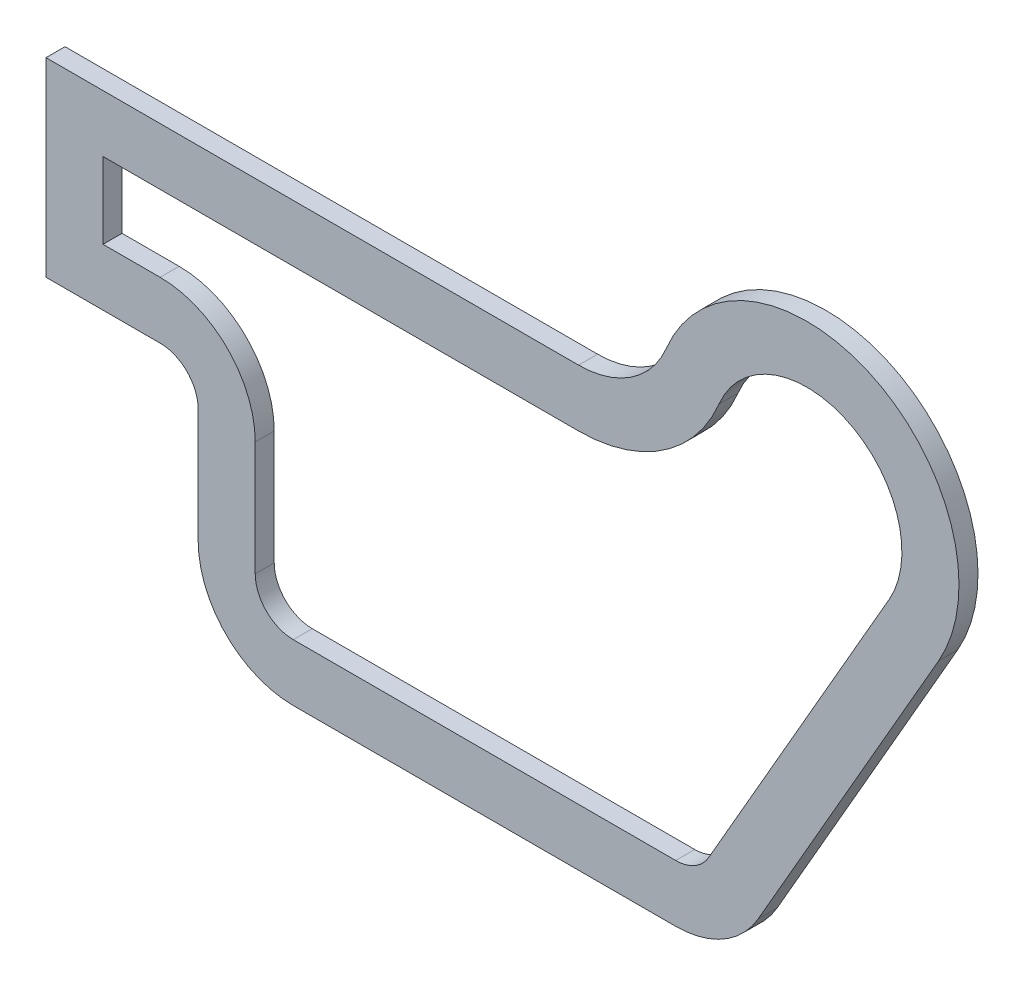
ISO-10303-21;
HEADER;
FILE_DESCRIPTION(('STEP AP214'),'2;1');
FILE_NAME('part.step','',(''),(''),'','','');
FILE_SCHEMA(('AUTOMOTIVE_DESIGN { 1 0 10303 214 1 1 1 1 }'));
ENDSEC;
DATA;
#1=APPLICATION_CONTEXT('core data for automotive mechanical design processes');
#2=APPLICATION_PROTOCOL_DEFINITION('international standard','automotive_design',2000,#1);
#3=PRODUCT_CONTEXT('',#1,'mechanical');
#4=PRODUCT('Part','Part','',(#3));
#5=PRODUCT_RELATED_PRODUCT_CATEGORY('part','',(#4));
#6=PRODUCT_DEFINITION_FORMATION('','',#4);
#7=PRODUCT_DEFINITION_CONTEXT('part definition',#1,'design');
#8=PRODUCT_DEFINITION('design','',#6,#7);
#9=PRODUCT_DEFINITION_SHAPE('','',#8);
#10=(LENGTH_UNIT() NAMED_UNIT(*) SI_UNIT(.MILLI.,.METRE.));
#11=(NAMED_UNIT(*) PLANE_ANGLE_UNIT() SI_UNIT($,.RADIAN.));
#12=(NAMED_UNIT(*) SI_UNIT($,.STERADIAN.) SOLID_ANGLE_UNIT());
#13=UNCERTAINTY_MEASURE_WITH_UNIT(LENGTH_MEASURE(1.E-05),#10,'distance_accuracy_value','');
#14=(GEOMETRIC_REPRESENTATION_CONTEXT(3) GLOBAL_UNCERTAINTY_ASSIGNED_CONTEXT((#13)) GLOBAL_UNIT_ASSIGNED_CONTEXT((#10,
#11,#12)) REPRESENTATION_CONTEXT('',''));
#15=CARTESIAN_POINT('',(0.,0.,0.));
#16=DIRECTION('',(0.,0.,1.));
#17=DIRECTION('',(1.,0.,0.));
#18=AXIS2_PLACEMENT_3D('',#15,#16,#17);
#19=CARTESIAN_POINT('',(140.,140.,0.));
#20=DIRECTION('',(0.,0.,-1.));
#21=DIRECTION('',(-1.,0.,0.));
#22=AXIS2_PLACEMENT_3D('',#19,#20,#21);
#23=PLANE('',#22);
#24=CARTESIAN_POINT('',(140.,140.,0.));
#25=DIRECTION('',(0.,0.,-1.));
#26=DIRECTION('',(-1.,0.,0.));
#27=AXIS2_PLACEMENT_3D('',#24,#25,#26);
#28=CIRCLE('',#27,25.);
#29=CARTESIAN_POINT('',(163.076923076923,130.384615384615,0.));
#30=VERTEX_POINT('',#29);
#31=CARTESIAN_POINT('',(140.,115.,0.));
#32=VERTEX_POINT('',#31);
#33=EDGE_CURVE('E314',#30,#32,#28,.T.);
#34=ORIENTED_EDGE('',*,*,#33,.F.);
#35=CARTESIAN_POINT('',(200.,115.,0.));
#36=DIRECTION('',(0.,0.,1.));
#37=DIRECTION('',(1.,0.,0.));
#38=AXIS2_PLACEMENT_3D('',#35,#36,#37);
#39=CIRCLE('',#38,40.);
#40=CARTESIAN_POINT('',(234.67371600643,95.05674504236,0.));
#41=VERTEX_POINT('',#40);
#42=EDGE_CURVE('E283',#41,#30,#39,.T.);
#43=ORIENTED_EDGE('',*,*,#42,.F.);
#44=DIRECTION('',(0.498581373941001,0.866842900160752,0.));
#45=VECTOR('',#44,1.);
#46=CARTESIAN_POINT('',(234.67371600643,95.05674504236,0.));
#47=LINE('',#46,#45);
#48=CARTESIAN_POINT('',(187.210014278647,12.5354656514751,0.));
#49=VERTEX_POINT('',#48);
#50=EDGE_CURVE('E342',#49,#41,#47,.T.);
#51=ORIENTED_EDGE('',*,*,#50,.F.);
#52=CARTESIAN_POINT('',(165.538941774628,25.,0.));
#53=DIRECTION('',(0.,0.,1.));
#54=DIRECTION('',(-1.,0.,0.));
#55=AXIS2_PLACEMENT_3D('',#52,#53,#54);
#56=CIRCLE('',#55,25.);
#57=CARTESIAN_POINT('',(165.538941774628,0.,0.));
#58=VERTEX_POINT('',#57);
#59=EDGE_CURVE('E339',#58,#49,#56,.T.);
#60=ORIENTED_EDGE('',*,*,#59,.F.);
#61=DIRECTION('',(1.,0.,0.));
#62=VECTOR('',#61,1.);
#63=CARTESIAN_POINT('',(165.538941774628,0.,0.));
#64=LINE('',#63,#62);
#65=CARTESIAN_POINT('',(65.0000000000002,0.,0.));
#66=VERTEX_POINT('',#65);
#67=EDGE_CURVE('E336',#66,#58,#64,.T.);
#68=ORIENTED_EDGE('',*,*,#67,.F.);
#69=CARTESIAN_POINT('',(65.,25.,0.));
#70=DIRECTION('',(0.,0.,1.));
#71=DIRECTION('',(-1.,0.,0.));
#72=AXIS2_PLACEMENT_3D('',#69,#70,#71);
#73=CIRCLE('',#72,25.);
#74=CARTESIAN_POINT('',(40.,25.,0.));
#75=VERTEX_POINT('',#74);
#76=EDGE_CURVE('E333',#75,#66,#73,.T.);
#77=ORIENTED_EDGE('',*,*,#76,.F.);
#78=DIRECTION('',(0.,-1.,0.));
#79=VECTOR('',#78,1.);
#80=CARTESIAN_POINT('',(40.,54.9999999999999,0.));
#81=LINE('',#80,#79);
#82=CARTESIAN_POINT('',(40.,54.9999999999999,0.));
#83=VERTEX_POINT('',#82);
#84=EDGE_CURVE('E330',#83,#75,#81,.T.);
#85=ORIENTED_EDGE('',*,*,#84,.F.);
#86=CARTESIAN_POINT('',(30.,55.,0.));
#87=DIRECTION('',(0.,0.,-1.));
#88=DIRECTION('',(1.,0.,0.));
#89=AXIS2_PLACEMENT_3D('',#86,#87,#88);
#90=CIRCLE('',#89,10.);
#91=CARTESIAN_POINT('',(29.9999999999999,65.,0.));
#92=VERTEX_POINT('',#91);
#93=EDGE_CURVE('E327',#92,#83,#90,.T.);
#94=ORIENTED_EDGE('',*,*,#93,.F.);
#95=DIRECTION('',(1.,0.,0.));
#96=VECTOR('',#95,1.);
#97=CARTESIAN_POINT('',(0.,65.,0.));
#98=LINE('',#97,#96);
#99=CARTESIAN_POINT('',(0.,65.,0.));
#100=VERTEX_POINT('',#99);
#101=EDGE_CURVE('E324',#100,#92,#98,.T.);
#102=ORIENTED_EDGE('',*,*,#101,.F.);
#103=DIRECTION('',(0.,-1.,0.));
#104=VECTOR('',#103,1.);
#105=CARTESIAN_POINT('',(0.,115.,0.));
#106=LINE('',#105,#104);
#107=CARTESIAN_POINT('',(0.,115.,0.));
#108=VERTEX_POINT('',#107);
#109=EDGE_CURVE('E321',#108,#100,#106,.T.);
#110=ORIENTED_EDGE('',*,*,#109,.F.);
#111=DIRECTION('',(-1.,0.,0.));
#112=VECTOR('',#111,1.);
#113=CARTESIAN_POINT('',(140.,115.,0.));
#114=LINE('',#113,#112);
#115=EDGE_CURVE('E318',#32,#108,#114,.T.);
#116=ORIENTED_EDGE('',*,*,#115,.F.);
#117=EDGE_LOOP('',(#34,#43,#51,#60,#68,#77,#85,#94,#102,#110,#116));
#118=FACE_BOUND('',#117,.T.);
#119=CARTESIAN_POINT('',(200.,115.,0.));
#120=DIRECTION('',(0.,0.,-1.));
#121=DIRECTION('',(-1.,0.,0.));
#122=AXIS2_PLACEMENT_3D('',#119,#120,#121);
#123=CIRCLE('',#122,25.);
#124=CARTESIAN_POINT('',(221.671072504019,102.535465651475,0.));
#125=VERTEX_POINT('',#124);
#126=CARTESIAN_POINT('',(176.923076923077,124.615384615385,0.));
#127=VERTEX_POINT('',#126);
#128=EDGE_CURVE('E191',#125,#127,#123,.F.);
#129=ORIENTED_EDGE('',*,*,#128,.T.);
#130=CARTESIAN_POINT('',(140.,140.,0.));
#131=DIRECTION('',(0.,0.,-1.));
#132=DIRECTION('',(-1.,0.,0.));
#133=AXIS2_PLACEMENT_3D('',#130,#131,#132);
#134=CIRCLE('',#133,40.);
#135=CARTESIAN_POINT('',(140.,100.,0.));
#136=VERTEX_POINT('',#135);
#137=EDGE_CURVE('E201',#127,#136,#134,.T.);
#138=ORIENTED_EDGE('',*,*,#137,.T.);
#139=DIRECTION('',(-1.,0.,0.));
#140=VECTOR('',#139,1.);
#141=CARTESIAN_POINT('',(140.,100.,0.));
#142=LINE('',#141,#140);
#143=CARTESIAN_POINT('',(15.,100.,0.));
#144=VERTEX_POINT('',#143);
#145=EDGE_CURVE('E208',#136,#144,#142,.T.);
#146=ORIENTED_EDGE('',*,*,#145,.T.);
#147=DIRECTION('',(0.,-1.,0.));
#148=VECTOR('',#147,1.);
#149=CARTESIAN_POINT('',(15.,140.,0.));
#150=LINE('',#149,#148);
#151=CARTESIAN_POINT('',(15.,80.,0.));
#152=VERTEX_POINT('',#151);
#153=EDGE_CURVE('E62',#144,#152,#150,.T.);
#154=ORIENTED_EDGE('',*,*,#153,.T.);
#155=DIRECTION('',(1.,0.,0.));
#156=VECTOR('',#155,1.);
#157=CARTESIAN_POINT('',(140.,80.,0.));
#158=LINE('',#157,#156);
#159=CARTESIAN_POINT('',(29.9999999999999,80.,0.));
#160=VERTEX_POINT('',#159);
#161=EDGE_CURVE('E242',#152,#160,#158,.T.);
#162=ORIENTED_EDGE('',*,*,#161,.T.);
#163=CARTESIAN_POINT('',(30.,55.,0.));
#164=DIRECTION('',(0.,0.,-1.));
#165=DIRECTION('',(-1.,0.,0.));
#166=AXIS2_PLACEMENT_3D('',#163,#164,#165);
#167=CIRCLE('',#166,25.);
#168=CARTESIAN_POINT('',(55.,54.9999999999998,0.));
#169=VERTEX_POINT('',#168);
#170=EDGE_CURVE('E238',#160,#169,#167,.T.);
#171=ORIENTED_EDGE('',*,*,#170,.T.);
#172=DIRECTION('',(0.,-1.,0.));
#173=VECTOR('',#172,1.);
#174=CARTESIAN_POINT('',(55.,140.,0.));
#175=LINE('',#174,#173);
#176=CARTESIAN_POINT('',(55.,25.,0.));
#177=VERTEX_POINT('',#176);
#178=EDGE_CURVE('E234',#169,#177,#175,.T.);
#179=ORIENTED_EDGE('',*,*,#178,.T.);
#180=CARTESIAN_POINT('',(65.,25.,0.));
#181=DIRECTION('',(0.,0.,-1.));
#182=DIRECTION('',(-1.,0.,0.));
#183=AXIS2_PLACEMENT_3D('',#180,#181,#182);
#184=CIRCLE('',#183,10.);
#185=CARTESIAN_POINT('',(65.0000000000001,15.,0.));
#186=VERTEX_POINT('',#185);
#187=EDGE_CURVE('E230',#177,#186,#184,.F.);
#188=ORIENTED_EDGE('',*,*,#187,.T.);
#189=DIRECTION('',(1.,0.,0.));
#190=VECTOR('',#189,1.);
#191=CARTESIAN_POINT('',(140.,15.,0.));
#192=LINE('',#191,#190);
#193=CARTESIAN_POINT('',(165.538941774628,15.,0.));
#194=VERTEX_POINT('',#193);
#195=EDGE_CURVE('E226',#186,#194,#192,.T.);
#196=ORIENTED_EDGE('',*,*,#195,.T.);
#197=CARTESIAN_POINT('',(165.538941774628,25.,0.));
#198=DIRECTION('',(0.,0.,-1.));
#199=DIRECTION('',(-1.,0.,0.));
#200=AXIS2_PLACEMENT_3D('',#197,#198,#199);
#201=CIRCLE('',#200,10.);
#202=CARTESIAN_POINT('',(174.207370776236,20.01418626059,0.));
#203=VERTEX_POINT('',#202);
#204=EDGE_CURVE('E220',#194,#203,#201,.F.);
#205=ORIENTED_EDGE('',*,*,#204,.T.);
#206=DIRECTION('',(0.498581373941001,0.866842900160752,0.));
#207=VECTOR('',#206,1.);
#208=CARTESIAN_POINT('',(217.560862421394,95.3893775412636,0.));
#209=LINE('',#208,#207);
#210=EDGE_CURVE('E212',#203,#125,#209,.T.);
#211=ORIENTED_EDGE('',*,*,#210,.T.);
#212=EDGE_LOOP('',(#129,#138,#146,#154,#162,#171,#179,#188,#196,#205,#211));
#213=FACE_BOUND('',#212,.T.);
#214=ADVANCED_FACE('F38',(#118,#213),#23,.T.);
#215=CARTESIAN_POINT('',(140.,140.,5.));
#216=DIRECTION('',(0.,0.,-1.));
#217=DIRECTION('',(-1.,0.,0.));
#218=AXIS2_PLACEMENT_3D('',#215,#216,#217);
#219=CYLINDRICAL_SURFACE('',#218,25.);
#220=ORIENTED_EDGE('',*,*,#33,.T.);
#221=DIRECTION('',(0.,0.,-1.));
#222=VECTOR('',#221,1.);
#223=CARTESIAN_POINT('',(140.,115.,5.));
#224=LINE('',#223,#222);
#225=CARTESIAN_POINT('',(140.,115.,5.));
#226=VERTEX_POINT('',#225);
#227=EDGE_CURVE('E11',#226,#32,#224,.T.);
#228=ORIENTED_EDGE('',*,*,#227,.F.);
#229=CARTESIAN_POINT('',(140.,140.,5.));
#230=DIRECTION('',(0.,0.,-1.));
#231=DIRECTION('',(-1.,0.,0.));
#232=AXIS2_PLACEMENT_3D('',#229,#230,#231);
#233=CIRCLE('',#232,25.);
#234=CARTESIAN_POINT('',(163.076923076923,130.384615384615,5.));
#235=VERTEX_POINT('',#234);
#236=EDGE_CURVE('E278',#235,#226,#233,.T.);
#237=ORIENTED_EDGE('',*,*,#236,.F.);
#238=DIRECTION('',(0.,0.,-1.));
#239=VECTOR('',#238,1.);
#240=CARTESIAN_POINT('',(163.076923076923,130.384615384615,5.));
#241=LINE('',#240,#239);
#242=EDGE_CURVE('E313',#235,#30,#241,.T.);
#243=ORIENTED_EDGE('',*,*,#242,.T.);
#244=EDGE_LOOP('',(#220,#228,#237,#243));
#245=FACE_BOUND('',#244,.T.);
#246=ADVANCED_FACE('F40',(#245),#219,.F.);
#247=CARTESIAN_POINT('',(140.,115.,5.));
#248=DIRECTION('',(0.,-1.,0.));
#249=DIRECTION('',(0.,0.,-1.));
#250=AXIS2_PLACEMENT_3D('',#247,#248,#249);
#251=PLANE('',#250);
#252=ORIENTED_EDGE('',*,*,#115,.T.);
#253=DIRECTION('',(0.,0.,-1.));
#254=VECTOR('',#253,1.);
#255=CARTESIAN_POINT('',(0.,115.,5.));
#256=LINE('',#255,#254);
#257=CARTESIAN_POINT('',(0.,115.,5.));
#258=VERTEX_POINT('',#257);
#259=EDGE_CURVE('E47',#258,#108,#256,.T.);
#260=ORIENTED_EDGE('',*,*,#259,.F.);
#261=DIRECTION('',(-1.,0.,0.));
#262=VECTOR('',#261,1.);
#263=CARTESIAN_POINT('',(140.,115.,5.));
#264=LINE('',#263,#262);
#265=EDGE_CURVE('E282',#226,#258,#264,.T.);
#266=ORIENTED_EDGE('',*,*,#265,.F.);
#267=ORIENTED_EDGE('',*,*,#227,.T.);
#268=EDGE_LOOP('',(#252,#260,#266,#267));
#269=FACE_BOUND('',#268,.T.);
#270=ADVANCED_FACE('F409',(#269),#251,.F.);
#271=CARTESIAN_POINT('',(0.,115.,5.));
#272=DIRECTION('',(1.,0.,0.));
#273=DIRECTION('',(0.,0.,-1.));
#274=AXIS2_PLACEMENT_3D('',#271,#272,#273);
#275=PLANE('',#274);
#276=ORIENTED_EDGE('',*,*,#109,.T.);
#277=DIRECTION('',(0.,0.,-1.));
#278=VECTOR('',#277,1.);
#279=CARTESIAN_POINT('',(0.,65.,5.));
#280=LINE('',#279,#278);
#281=CARTESIAN_POINT('',(0.,65.,5.));
#282=VERTEX_POINT('',#281);
#283=EDGE_CURVE('E378',#282,#100,#280,.T.);
#284=ORIENTED_EDGE('',*,*,#283,.F.);
#285=DIRECTION('',(0.,-1.,0.));
#286=VECTOR('',#285,1.);
#287=CARTESIAN_POINT('',(0.,115.,5.));
#288=LINE('',#287,#286);
#289=EDGE_CURVE('E286',#258,#282,#288,.T.);
#290=ORIENTED_EDGE('',*,*,#289,.F.);
#291=ORIENTED_EDGE('',*,*,#259,.T.);
#292=EDGE_LOOP('',(#276,#284,#290,#291));
#293=FACE_BOUND('',#292,.T.);
#294=ADVANCED_FACE('F387',(#293),#275,.F.);
#295=CARTESIAN_POINT('',(0.,65.,5.));
#296=DIRECTION('',(0.,1.,0.));
#297=DIRECTION('',(0.,0.,1.));
#298=AXIS2_PLACEMENT_3D('',#295,#296,#297);
#299=PLANE('',#298);
#300=ORIENTED_EDGE('',*,*,#101,.T.);
#301=DIRECTION('',(0.,0.,-1.));
#302=VECTOR('',#301,1.);
#303=CARTESIAN_POINT('',(29.9999999999999,65.,5.));
#304=LINE('',#303,#302);
#305=CARTESIAN_POINT('',(29.9999999999999,65.,5.));
#306=VERTEX_POINT('',#305);
#307=EDGE_CURVE('E374',#306,#92,#304,.T.);
#308=ORIENTED_EDGE('',*,*,#307,.F.);
#309=DIRECTION('',(1.,0.,0.));
#310=VECTOR('',#309,1.);
#311=CARTESIAN_POINT('',(0.,65.,5.));
#312=LINE('',#311,#310);
#313=EDGE_CURVE('E289',#282,#306,#312,.T.);
#314=ORIENTED_EDGE('',*,*,#313,.F.);
#315=ORIENTED_EDGE('',*,*,#283,.T.);
#316=EDGE_LOOP('',(#300,#308,#314,#315));
#317=FACE_BOUND('',#316,.T.);
#318=ADVANCED_FACE('F397',(#317),#299,.F.);
#319=CARTESIAN_POINT('',(30.,55.,5.));
#320=DIRECTION('',(0.,0.,-1.));
#321=DIRECTION('',(-1.,0.,0.));
#322=AXIS2_PLACEMENT_3D('',#319,#320,#321);
#323=CYLINDRICAL_SURFACE('',#322,10.);
#324=ORIENTED_EDGE('',*,*,#93,.T.);
#325=DIRECTION('',(0.,0.,-1.));
#326=VECTOR('',#325,1.);
#327=CARTESIAN_POINT('',(40.,54.9999999999999,5.));
#328=LINE('',#327,#326);
#329=CARTESIAN_POINT('',(40.,54.9999999999999,5.));
#330=VERTEX_POINT('',#329);
#331=EDGE_CURVE('E370',#330,#83,#328,.T.);
#332=ORIENTED_EDGE('',*,*,#331,.F.);
#333=CARTESIAN_POINT('',(30.,55.,5.));
#334=DIRECTION('',(0.,0.,-1.));
#335=DIRECTION('',(1.,0.,0.));
#336=AXIS2_PLACEMENT_3D('',#333,#334,#335);
#337=CIRCLE('',#336,10.);
#338=EDGE_CURVE('E292',#306,#330,#337,.T.);
#339=ORIENTED_EDGE('',*,*,#338,.F.);
#340=ORIENTED_EDGE('',*,*,#307,.T.);
#341=EDGE_LOOP('',(#324,#332,#339,#340));
#342=FACE_BOUND('',#341,.T.);
#343=ADVANCED_FACE('F401',(#342),#323,.F.);
#344=CARTESIAN_POINT('',(40.,54.9999999999999,5.));
#345=DIRECTION('',(1.,0.,0.));
#346=DIRECTION('',(0.,1.,0.));
#347=AXIS2_PLACEMENT_3D('',#344,#345,#346);
#348=PLANE('',#347);
#349=ORIENTED_EDGE('',*,*,#84,.T.);
#350=DIRECTION('',(0.,0.,-1.));
#351=VECTOR('',#350,1.);
#352=CARTESIAN_POINT('',(40.,25.,5.));
#353=LINE('',#352,#351);
#354=CARTESIAN_POINT('',(40.,25.,5.));
#355=VERTEX_POINT('',#354);
#356=EDGE_CURVE('E366',#355,#75,#353,.T.);
#357=ORIENTED_EDGE('',*,*,#356,.F.);
#358=DIRECTION('',(0.,-1.,0.));
#359=VECTOR('',#358,1.);
#360=CARTESIAN_POINT('',(40.,54.9999999999999,5.));
#361=LINE('',#360,#359);
#362=EDGE_CURVE('E295',#330,#355,#361,.T.);
#363=ORIENTED_EDGE('',*,*,#362,.F.);
#364=ORIENTED_EDGE('',*,*,#331,.T.);
#365=EDGE_LOOP('',(#349,#357,#363,#364));
#366=FACE_BOUND('',#365,.T.);
#367=ADVANCED_FACE('F437',(#366),#348,.F.);
#368=CARTESIAN_POINT('',(65.,25.,5.));
#369=DIRECTION('',(0.,0.,-1.));
#370=DIRECTION('',(-1.,0.,0.));
#371=AXIS2_PLACEMENT_3D('',#368,#369,#370);
#372=CYLINDRICAL_SURFACE('',#371,25.);
#373=ORIENTED_EDGE('',*,*,#76,.T.);
#374=DIRECTION('',(0.,0.,-1.));
#375=VECTOR('',#374,1.);
#376=CARTESIAN_POINT('',(65.0000000000002,0.,5.));
#377=LINE('',#376,#375);
#378=CARTESIAN_POINT('',(65.0000000000002,0.,5.));
#379=VERTEX_POINT('',#378);
#380=EDGE_CURVE('E362',#379,#66,#377,.T.);
#381=ORIENTED_EDGE('',*,*,#380,.F.);
#382=CARTESIAN_POINT('',(65.,25.,5.));
#383=DIRECTION('',(0.,0.,1.));
#384=DIRECTION('',(-1.,0.,0.));
#385=AXIS2_PLACEMENT_3D('',#382,#383,#384);
#386=CIRCLE('',#385,25.);
#387=EDGE_CURVE('E298',#355,#379,#386,.T.);
#388=ORIENTED_EDGE('',*,*,#387,.F.);
#389=ORIENTED_EDGE('',*,*,#356,.T.);
#390=EDGE_LOOP('',(#373,#381,#388,#389));
#391=FACE_BOUND('',#390,.T.);
#392=ADVANCED_FACE('F435',(#391),#372,.T.);
#393=CARTESIAN_POINT('',(165.538941774628,0.,5.));
#394=DIRECTION('',(0.,1.,0.));
#395=DIRECTION('',(-1.,0.,0.));
#396=AXIS2_PLACEMENT_3D('',#393,#394,#395);
#397=PLANE('',#396);
#398=ORIENTED_EDGE('',*,*,#67,.T.);
#399=DIRECTION('',(0.,0.,-1.));
#400=VECTOR('',#399,1.);
#401=CARTESIAN_POINT('',(165.538941774628,0.,5.));
#402=LINE('',#401,#400);
#403=CARTESIAN_POINT('',(165.538941774628,0.,5.));
#404=VERTEX_POINT('',#403);
#405=EDGE_CURVE('E358',#404,#58,#402,.T.);
#406=ORIENTED_EDGE('',*,*,#405,.F.);
#407=DIRECTION('',(1.,0.,0.));
#408=VECTOR('',#407,1.);
#409=CARTESIAN_POINT('',(165.538941774628,0.,5.));
#410=LINE('',#409,#408);
#411=EDGE_CURVE('E301',#379,#404,#410,.T.);
#412=ORIENTED_EDGE('',*,*,#411,.F.);
#413=ORIENTED_EDGE('',*,*,#380,.T.);
#414=EDGE_LOOP('',(#398,#406,#412,#413));
#415=FACE_BOUND('',#414,.T.);
#416=ADVANCED_FACE('F430',(#415),#397,.F.);
#417=CARTESIAN_POINT('',(165.538941774628,25.,5.));
#418=DIRECTION('',(0.,0.,-1.));
#419=DIRECTION('',(-1.,0.,0.));
#420=AXIS2_PLACEMENT_3D('',#417,#418,#419);
#421=CYLINDRICAL_SURFACE('',#420,25.);
#422=ORIENTED_EDGE('',*,*,#59,.T.);
#423=DIRECTION('',(0.,0.,-1.));
#424=VECTOR('',#423,1.);
#425=CARTESIAN_POINT('',(187.210014278647,12.5354656514751,5.));
#426=LINE('',#425,#424);
#427=CARTESIAN_POINT('',(187.210014278647,12.5354656514751,5.));
#428=VERTEX_POINT('',#427);
#429=EDGE_CURVE('E354',#428,#49,#426,.T.);
#430=ORIENTED_EDGE('',*,*,#429,.F.);
#431=CARTESIAN_POINT('',(165.538941774628,25.,5.));
#432=DIRECTION('',(0.,0.,1.));
#433=DIRECTION('',(-1.,0.,0.));
#434=AXIS2_PLACEMENT_3D('',#431,#432,#433);
#435=CIRCLE('',#434,25.);
#436=EDGE_CURVE('E304',#404,#428,#435,.T.);
#437=ORIENTED_EDGE('',*,*,#436,.F.);
#438=ORIENTED_EDGE('',*,*,#405,.T.);
#439=EDGE_LOOP('',(#422,#430,#437,#438));
#440=FACE_BOUND('',#439,.T.);
#441=ADVANCED_FACE('F425',(#440),#421,.T.);
#442=CARTESIAN_POINT('',(234.67371600643,95.05674504236,5.));
#443=DIRECTION('',(-0.866842900160752,0.498581373941001,0.));
#444=DIRECTION('',(-0.498581373941001,-0.866842900160752,0.));
#445=AXIS2_PLACEMENT_3D('',#442,#443,#444);
#446=PLANE('',#445);
#447=ORIENTED_EDGE('',*,*,#50,.T.);
#448=DIRECTION('',(0.,0.,-1.));
#449=VECTOR('',#448,1.);
#450=CARTESIAN_POINT('',(234.67371600643,95.05674504236,5.));
#451=LINE('',#450,#449);
#452=CARTESIAN_POINT('',(234.67371600643,95.05674504236,5.));
#453=VERTEX_POINT('',#452);
#454=EDGE_CURVE('E350',#453,#41,#451,.T.);
#455=ORIENTED_EDGE('',*,*,#454,.F.);
#456=DIRECTION('',(0.498581373941001,0.866842900160752,0.));
#457=VECTOR('',#456,1.);
#458=CARTESIAN_POINT('',(234.67371600643,95.05674504236,5.));
#459=LINE('',#458,#457);
#460=EDGE_CURVE('E307',#428,#453,#459,.T.);
#461=ORIENTED_EDGE('',*,*,#460,.F.);
#462=ORIENTED_EDGE('',*,*,#429,.T.);
#463=EDGE_LOOP('',(#447,#455,#461,#462));
#464=FACE_BOUND('',#463,.T.);
#465=ADVANCED_FACE('F421',(#464),#446,.F.);
#466=CARTESIAN_POINT('',(200.,115.,5.));
#467=DIRECTION('',(0.,0.,-1.));
#468=DIRECTION('',(-1.,0.,0.));
#469=AXIS2_PLACEMENT_3D('',#466,#467,#468);
#470=CYLINDRICAL_SURFACE('',#469,40.);
#471=ORIENTED_EDGE('',*,*,#42,.T.);
#472=ORIENTED_EDGE('',*,*,#242,.F.);
#473=CARTESIAN_POINT('',(200.,115.,5.));
#474=DIRECTION('',(0.,0.,1.));
#475=DIRECTION('',(1.,0.,0.));
#476=AXIS2_PLACEMENT_3D('',#473,#474,#475);
#477=CIRCLE('',#476,40.);
#478=EDGE_CURVE('E310',#453,#235,#477,.T.);
#479=ORIENTED_EDGE('',*,*,#478,.F.);
#480=ORIENTED_EDGE('',*,*,#454,.T.);
#481=EDGE_LOOP('',(#471,#472,#479,#480));
#482=FACE_BOUND('',#481,.T.);
#483=ADVANCED_FACE('F416',(#482),#470,.T.);
#484=CARTESIAN_POINT('',(140.,140.,5.));
#485=DIRECTION('',(0.,0.,-1.));
#486=DIRECTION('',(-1.,0.,0.));
#487=AXIS2_PLACEMENT_3D('',#484,#485,#486);
#488=PLANE('',#487);
#489=CARTESIAN_POINT('',(140.,140.,5.));
#490=DIRECTION('',(0.,0.,-1.));
#491=DIRECTION('',(-1.,0.,0.));
#492=AXIS2_PLACEMENT_3D('',#489,#490,#491);
#493=CIRCLE('',#492,40.);
#494=CARTESIAN_POINT('',(176.923076923077,124.615384615385,5.));
#495=VERTEX_POINT('',#494);
#496=CARTESIAN_POINT('',(140.,100.,5.));
#497=VERTEX_POINT('',#496);
#498=EDGE_CURVE('E214',#495,#497,#493,.T.);
#499=ORIENTED_EDGE('',*,*,#498,.F.);
#500=CARTESIAN_POINT('',(200.,115.,5.));
#501=DIRECTION('',(0.,0.,-1.));
#502=DIRECTION('',(-1.,0.,0.));
#503=AXIS2_PLACEMENT_3D('',#500,#501,#502);
#504=CIRCLE('',#503,25.);
#505=CARTESIAN_POINT('',(221.671072504019,102.535465651475,5.));
#506=VERTEX_POINT('',#505);
#507=EDGE_CURVE('E194',#506,#495,#504,.F.);
#508=ORIENTED_EDGE('',*,*,#507,.F.);
#509=DIRECTION('',(0.498581373941001,0.866842900160752,0.));
#510=VECTOR('',#509,1.);
#511=CARTESIAN_POINT('',(217.560862421394,95.3893775412636,5.));
#512=LINE('',#511,#510);
#513=CARTESIAN_POINT('',(174.207370776236,20.01418626059,5.));
#514=VERTEX_POINT('',#513);
#515=EDGE_CURVE('E273',#514,#506,#512,.T.);
#516=ORIENTED_EDGE('',*,*,#515,.F.);
#517=CARTESIAN_POINT('',(165.538941774628,25.,5.));
#518=DIRECTION('',(0.,0.,-1.));
#519=DIRECTION('',(-1.,0.,0.));
#520=AXIS2_PLACEMENT_3D('',#517,#518,#519);
#521=CIRCLE('',#520,10.);
#522=CARTESIAN_POINT('',(165.538941774628,15.,5.));
#523=VERTEX_POINT('',#522);
#524=EDGE_CURVE('E270',#523,#514,#521,.F.);
#525=ORIENTED_EDGE('',*,*,#524,.F.);
#526=DIRECTION('',(1.,0.,0.));
#527=VECTOR('',#526,1.);
#528=CARTESIAN_POINT('',(140.,15.,5.));
#529=LINE('',#528,#527);
#530=CARTESIAN_POINT('',(65.0000000000001,15.,5.));
#531=VERTEX_POINT('',#530);
#532=EDGE_CURVE('E267',#531,#523,#529,.T.);
#533=ORIENTED_EDGE('',*,*,#532,.F.);
#534=CARTESIAN_POINT('',(65.,25.,5.));
#535=DIRECTION('',(0.,0.,-1.));
#536=DIRECTION('',(-1.,0.,0.));
#537=AXIS2_PLACEMENT_3D('',#534,#535,#536);
#538=CIRCLE('',#537,10.);
#539=CARTESIAN_POINT('',(55.,25.,5.));
#540=VERTEX_POINT('',#539);
#541=EDGE_CURVE('E264',#540,#531,#538,.F.);
#542=ORIENTED_EDGE('',*,*,#541,.F.);
#543=DIRECTION('',(0.,-1.,0.));
#544=VECTOR('',#543,1.);
#545=CARTESIAN_POINT('',(55.,140.,5.));
#546=LINE('',#545,#544);
#547=CARTESIAN_POINT('',(55.,54.9999999999998,5.));
#548=VERTEX_POINT('',#547);
#549=EDGE_CURVE('E261',#548,#540,#546,.T.);
#550=ORIENTED_EDGE('',*,*,#549,.F.);
#551=CARTESIAN_POINT('',(30.,55.,5.));
#552=DIRECTION('',(0.,0.,-1.));
#553=DIRECTION('',(-1.,0.,0.));
#554=AXIS2_PLACEMENT_3D('',#551,#552,#553);
#555=CIRCLE('',#554,25.);
#556=CARTESIAN_POINT('',(29.9999999999999,80.,5.));
#557=VERTEX_POINT('',#556);
#558=EDGE_CURVE('E258',#557,#548,#555,.T.);
#559=ORIENTED_EDGE('',*,*,#558,.F.);
#560=DIRECTION('',(1.,0.,0.));
#561=VECTOR('',#560,1.);
#562=CARTESIAN_POINT('',(140.,80.,5.));
#563=LINE('',#562,#561);
#564=CARTESIAN_POINT('',(15.,80.,5.));
#565=VERTEX_POINT('',#564);
#566=EDGE_CURVE('E255',#565,#557,#563,.T.);
#567=ORIENTED_EDGE('',*,*,#566,.F.);
#568=DIRECTION('',(0.,-1.,0.));
#569=VECTOR('',#568,1.);
#570=CARTESIAN_POINT('',(15.,140.,5.));
#571=LINE('',#570,#569);
#572=CARTESIAN_POINT('',(15.,100.,5.));
#573=VERTEX_POINT('',#572);
#574=EDGE_CURVE('E252',#573,#565,#571,.T.);
#575=ORIENTED_EDGE('',*,*,#574,.F.);
#576=DIRECTION('',(-1.,0.,0.));
#577=VECTOR('',#576,1.);
#578=CARTESIAN_POINT('',(140.,100.,5.));
#579=LINE('',#578,#577);
#580=EDGE_CURVE('E218',#497,#573,#579,.T.);
#581=ORIENTED_EDGE('',*,*,#580,.F.);
#582=EDGE_LOOP('',(#499,#508,#516,#525,#533,#542,#550,#559,#567,#575,#581));
#583=FACE_BOUND('',#582,.T.);
#584=ORIENTED_EDGE('',*,*,#236,.T.);
#585=ORIENTED_EDGE('',*,*,#265,.T.);
#586=ORIENTED_EDGE('',*,*,#289,.T.);
#587=ORIENTED_EDGE('',*,*,#313,.T.);
#588=ORIENTED_EDGE('',*,*,#338,.T.);
#589=ORIENTED_EDGE('',*,*,#362,.T.);
#590=ORIENTED_EDGE('',*,*,#387,.T.);
#591=ORIENTED_EDGE('',*,*,#411,.T.);
#592=ORIENTED_EDGE('',*,*,#436,.T.);
#593=ORIENTED_EDGE('',*,*,#460,.T.);
#594=ORIENTED_EDGE('',*,*,#478,.T.);
#595=EDGE_LOOP('',(#584,#585,#586,#587,#588,#589,#590,#591,#592,#593,#594));
#596=FACE_BOUND('',#595,.T.);
#597=ADVANCED_FACE('F405',(#583,#596),#488,.F.);
#598=CARTESIAN_POINT('',(140.,140.,5.));
#599=DIRECTION('',(0.,0.,-1.));
#600=DIRECTION('',(-1.,0.,0.));
#601=AXIS2_PLACEMENT_3D('',#598,#599,#600);
#602=CYLINDRICAL_SURFACE('',#601,40.);
#603=ORIENTED_EDGE('',*,*,#137,.F.);
#604=DIRECTION('',(0.,0.,-1.));
#605=VECTOR('',#604,1.);
#606=CARTESIAN_POINT('',(176.923076923077,124.615384615385,5.));
#607=LINE('',#606,#605);
#608=EDGE_CURVE('E187',#495,#127,#607,.T.);
#609=ORIENTED_EDGE('',*,*,#608,.F.);
#610=ORIENTED_EDGE('',*,*,#498,.T.);
#611=DIRECTION('',(0.,0.,-1.));
#612=VECTOR('',#611,1.);
#613=CARTESIAN_POINT('',(140.,100.,5.));
#614=LINE('',#613,#612);
#615=EDGE_CURVE('E204',#497,#136,#614,.T.);
#616=ORIENTED_EDGE('',*,*,#615,.T.);
#617=EDGE_LOOP('',(#603,#609,#610,#616));
#618=FACE_BOUND('',#617,.T.);
#619=ADVANCED_FACE('F202',(#618),#602,.T.);
#620=CARTESIAN_POINT('',(140.,100.,5.));
#621=DIRECTION('',(0.,-1.,0.));
#622=DIRECTION('',(0.,0.,-1.));
#623=AXIS2_PLACEMENT_3D('',#620,#621,#622);
#624=PLANE('',#623);
#625=ORIENTED_EDGE('',*,*,#145,.F.);
#626=ORIENTED_EDGE('',*,*,#615,.F.);
#627=ORIENTED_EDGE('',*,*,#580,.T.);
#628=DIRECTION('',(0.,0.,-1.));
#629=VECTOR('',#628,1.);
#630=CARTESIAN_POINT('',(15.,100.,5.));
#631=LINE('',#630,#629);
#632=EDGE_CURVE('E675',#573,#144,#631,.T.);
#633=ORIENTED_EDGE('',*,*,#632,.T.);
#634=EDGE_LOOP('',(#625,#626,#627,#633));
#635=FACE_BOUND('',#634,.T.);
#636=ADVANCED_FACE('F489',(#635),#624,.T.);
#637=CARTESIAN_POINT('',(15.,115.,5.));
#638=DIRECTION('',(1.,0.,0.));
#639=DIRECTION('',(0.,0.,-1.));
#640=AXIS2_PLACEMENT_3D('',#637,#638,#639);
#641=PLANE('',#640);
#642=ORIENTED_EDGE('',*,*,#153,.F.);
#643=ORIENTED_EDGE('',*,*,#632,.F.);
#644=ORIENTED_EDGE('',*,*,#574,.T.);
#645=DIRECTION('',(0.,0.,-1.));
#646=VECTOR('',#645,1.);
#647=CARTESIAN_POINT('',(15.,80.,5.));
#648=LINE('',#647,#646);
#649=EDGE_CURVE('E672',#565,#152,#648,.T.);
#650=ORIENTED_EDGE('',*,*,#649,.T.);
#651=EDGE_LOOP('',(#642,#643,#644,#650));
#652=FACE_BOUND('',#651,.T.);
#653=ADVANCED_FACE('F496',(#652),#641,.T.);
#654=CARTESIAN_POINT('',(0.,80.,5.));
#655=DIRECTION('',(0.,1.,0.));
#656=DIRECTION('',(0.,0.,1.));
#657=AXIS2_PLACEMENT_3D('',#654,#655,#656);
#658=PLANE('',#657);
#659=ORIENTED_EDGE('',*,*,#161,.F.);
#660=ORIENTED_EDGE('',*,*,#649,.F.);
#661=ORIENTED_EDGE('',*,*,#566,.T.);
#662=DIRECTION('',(0.,0.,-1.));
#663=VECTOR('',#662,1.);
#664=CARTESIAN_POINT('',(29.9999999999998,80.,5.));
#665=LINE('',#664,#663);
#666=EDGE_CURVE('E669',#557,#160,#665,.T.);
#667=ORIENTED_EDGE('',*,*,#666,.T.);
#668=EDGE_LOOP('',(#659,#660,#661,#667));
#669=FACE_BOUND('',#668,.T.);
#670=ADVANCED_FACE('F504',(#669),#658,.T.);
#671=CARTESIAN_POINT('',(30.,55.,5.));
#672=DIRECTION('',(0.,0.,-1.));
#673=DIRECTION('',(-1.,0.,0.));
#674=AXIS2_PLACEMENT_3D('',#671,#672,#673);
#675=CYLINDRICAL_SURFACE('',#674,25.);
#676=ORIENTED_EDGE('',*,*,#170,.F.);
#677=ORIENTED_EDGE('',*,*,#666,.F.);
#678=ORIENTED_EDGE('',*,*,#558,.T.);
#679=DIRECTION('',(0.,0.,1.));
#680=VECTOR('',#679,1.);
#681=CARTESIAN_POINT('',(55.,54.9999999999999,5.));
#682=LINE('',#681,#680);
#683=EDGE_CURVE('E666',#548,#169,#682,.F.);
#684=ORIENTED_EDGE('',*,*,#683,.T.);
#685=EDGE_LOOP('',(#676,#677,#678,#684));
#686=FACE_BOUND('',#685,.T.);
#687=ADVANCED_FACE('F511',(#686),#675,.T.);
#688=CARTESIAN_POINT('',(55.,54.9999999999999,5.));
#689=DIRECTION('',(1.,0.,0.));
#690=DIRECTION('',(0.,1.,0.));
#691=AXIS2_PLACEMENT_3D('',#688,#689,#690);
#692=PLANE('',#691);
#693=ORIENTED_EDGE('',*,*,#178,.F.);
#694=ORIENTED_EDGE('',*,*,#683,.F.);
#695=ORIENTED_EDGE('',*,*,#549,.T.);
#696=DIRECTION('',(0.,0.,-1.));
#697=VECTOR('',#696,1.);
#698=CARTESIAN_POINT('',(55.,25.,5.));
#699=LINE('',#698,#697);
#700=EDGE_CURVE('E663',#540,#177,#699,.T.);
#701=ORIENTED_EDGE('',*,*,#700,.T.);
#702=EDGE_LOOP('',(#693,#694,#695,#701));
#703=FACE_BOUND('',#702,.T.);
#704=ADVANCED_FACE('F519',(#703),#692,.T.);
#705=CARTESIAN_POINT('',(65.,25.,5.));
#706=DIRECTION('',(0.,0.,-1.));
#707=DIRECTION('',(-1.,0.,0.));
#708=AXIS2_PLACEMENT_3D('',#705,#706,#707);
#709=CYLINDRICAL_SURFACE('',#708,10.);
#710=ORIENTED_EDGE('',*,*,#187,.F.);
#711=ORIENTED_EDGE('',*,*,#700,.F.);
#712=ORIENTED_EDGE('',*,*,#541,.T.);
#713=DIRECTION('',(0.,0.,1.));
#714=VECTOR('',#713,1.);
#715=CARTESIAN_POINT('',(65.0000000000002,15.,5.));
#716=LINE('',#715,#714);
#717=EDGE_CURVE('E658',#531,#186,#716,.F.);
#718=ORIENTED_EDGE('',*,*,#717,.T.);
#719=EDGE_LOOP('',(#710,#711,#712,#718));
#720=FACE_BOUND('',#719,.T.);
#721=ADVANCED_FACE('F527',(#720),#709,.F.);
#722=CARTESIAN_POINT('',(165.538941774628,15.,5.));
#723=DIRECTION('',(0.,1.,0.));
#724=DIRECTION('',(-1.,0.,0.));
#725=AXIS2_PLACEMENT_3D('',#722,#723,#724);
#726=PLANE('',#725);
#727=ORIENTED_EDGE('',*,*,#195,.F.);
#728=ORIENTED_EDGE('',*,*,#717,.F.);
#729=ORIENTED_EDGE('',*,*,#532,.T.);
#730=DIRECTION('',(0.,0.,-1.));
#731=VECTOR('',#730,1.);
#732=CARTESIAN_POINT('',(165.538941774628,15.,5.));
#733=LINE('',#732,#731);
#734=EDGE_CURVE('E652',#523,#194,#733,.T.);
#735=ORIENTED_EDGE('',*,*,#734,.T.);
#736=EDGE_LOOP('',(#727,#728,#729,#735));
#737=FACE_BOUND('',#736,.T.);
#738=ADVANCED_FACE('F535',(#737),#726,.T.);
#739=CARTESIAN_POINT('',(165.538941774628,25.,5.));
#740=DIRECTION('',(0.,0.,-1.));
#741=DIRECTION('',(-1.,0.,0.));
#742=AXIS2_PLACEMENT_3D('',#739,#740,#741);
#743=CYLINDRICAL_SURFACE('',#742,10.);
#744=ORIENTED_EDGE('',*,*,#204,.F.);
#745=ORIENTED_EDGE('',*,*,#734,.F.);
#746=ORIENTED_EDGE('',*,*,#524,.T.);
#747=DIRECTION('',(0.,0.,1.));
#748=VECTOR('',#747,1.);
#749=CARTESIAN_POINT('',(174.207370776236,20.0141862605901,5.));
#750=LINE('',#749,#748);
#751=EDGE_CURVE('E647',#514,#203,#750,.F.);
#752=ORIENTED_EDGE('',*,*,#751,.T.);
#753=EDGE_LOOP('',(#744,#745,#746,#752));
#754=FACE_BOUND('',#753,.T.);
#755=ADVANCED_FACE('F543',(#754),#743,.F.);
#756=CARTESIAN_POINT('',(221.671072504019,102.535465651475,5.));
#757=DIRECTION('',(-0.866842900160752,0.498581373941001,0.));
#758=DIRECTION('',(-0.498581373941001,-0.866842900160752,0.));
#759=AXIS2_PLACEMENT_3D('',#756,#757,#758);
#760=PLANE('',#759);
#761=ORIENTED_EDGE('',*,*,#210,.F.);
#762=ORIENTED_EDGE('',*,*,#751,.F.);
#763=ORIENTED_EDGE('',*,*,#515,.T.);
#764=DIRECTION('',(0.,0.,-1.));
#765=VECTOR('',#764,1.);
#766=CARTESIAN_POINT('',(221.671072504019,102.535465651475,5.));
#767=LINE('',#766,#765);
#768=EDGE_CURVE('E54',#506,#125,#767,.T.);
#769=ORIENTED_EDGE('',*,*,#768,.T.);
#770=EDGE_LOOP('',(#761,#762,#763,#769));
#771=FACE_BOUND('',#770,.T.);
#772=ADVANCED_FACE('F551',(#771),#760,.T.);
#773=CARTESIAN_POINT('',(200.,115.,5.));
#774=DIRECTION('',(0.,0.,-1.));
#775=DIRECTION('',(-1.,0.,0.));
#776=AXIS2_PLACEMENT_3D('',#773,#774,#775);
#777=CYLINDRICAL_SURFACE('',#776,25.);
#778=ORIENTED_EDGE('',*,*,#128,.F.);
#779=ORIENTED_EDGE('',*,*,#768,.F.);
#780=ORIENTED_EDGE('',*,*,#507,.T.);
#781=ORIENTED_EDGE('',*,*,#608,.T.);
#782=EDGE_LOOP('',(#778,#779,#780,#781));
#783=FACE_BOUND('',#782,.T.);
#784=ADVANCED_FACE('F189',(#783),#777,.F.);
#785=CLOSED_SHELL('',(#214,#246,#270,#294,#318,#343,#367,#392,#416,#441,#465,#483,#597,#619,
#636,#653,#670,#687,#704,#721,#738,#755,#772,#784));
#786=MANIFOLD_SOLID_BREP('B2',#785);
#787=ADVANCED_BREP_SHAPE_REPRESENTATION('',(#18,#786),#14);
#788=SHAPE_DEFINITION_REPRESENTATION(#9,#787);
ENDSEC;
END-ISO-10303-21;
